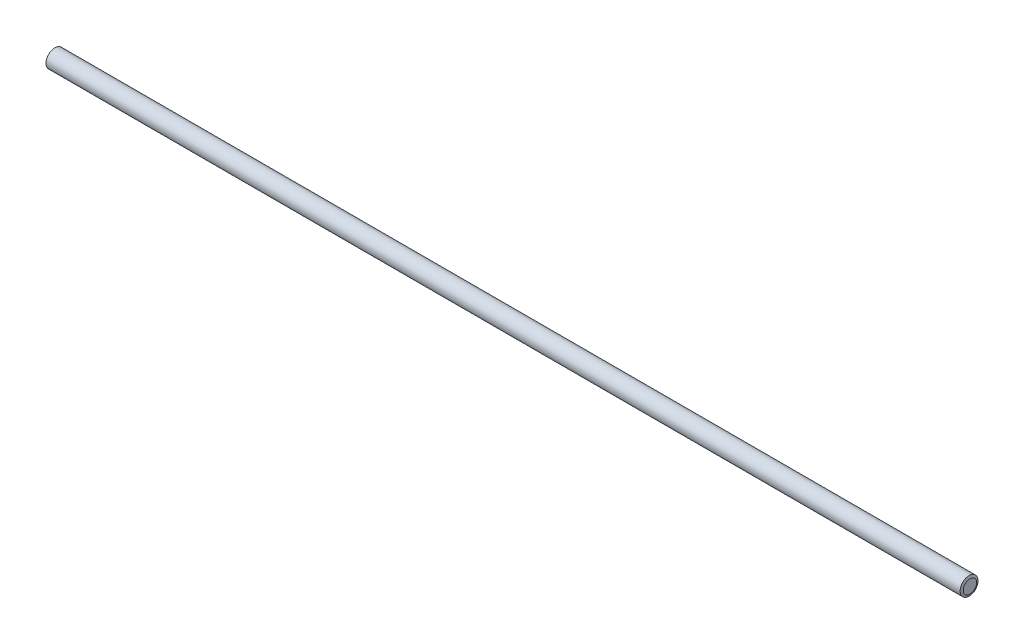
ISO-10303-21;
HEADER;
FILE_DESCRIPTION(('STEP AP214'),'2;1');
FILE_NAME('part.step','',(''),(''),'','','');
FILE_SCHEMA(('AUTOMOTIVE_DESIGN { 1 0 10303 214 1 1 1 1 }'));
ENDSEC;
DATA;
#1=APPLICATION_CONTEXT('core data for automotive mechanical design processes');
#2=APPLICATION_PROTOCOL_DEFINITION('international standard','automotive_design',2000,#1);
#3=PRODUCT_CONTEXT('',#1,'mechanical');
#4=PRODUCT('Part','Part','',(#3));
#5=PRODUCT_RELATED_PRODUCT_CATEGORY('part','',(#4));
#6=PRODUCT_DEFINITION_FORMATION('','',#4);
#7=PRODUCT_DEFINITION_CONTEXT('part definition',#1,'design');
#8=PRODUCT_DEFINITION('design','',#6,#7);
#9=PRODUCT_DEFINITION_SHAPE('','',#8);
#10=(LENGTH_UNIT() NAMED_UNIT(*) SI_UNIT(.MILLI.,.METRE.));
#11=(NAMED_UNIT(*) PLANE_ANGLE_UNIT() SI_UNIT($,.RADIAN.));
#12=(NAMED_UNIT(*) SI_UNIT($,.STERADIAN.) SOLID_ANGLE_UNIT());
#13=UNCERTAINTY_MEASURE_WITH_UNIT(LENGTH_MEASURE(1.E-05),#10,'distance_accuracy_value','');
#14=(GEOMETRIC_REPRESENTATION_CONTEXT(3) GLOBAL_UNCERTAINTY_ASSIGNED_CONTEXT((#13)) GLOBAL_UNIT_ASSIGNED_CONTEXT((#10,
#11,#12)) REPRESENTATION_CONTEXT('',''));
#15=CARTESIAN_POINT('',(0.,0.,0.));
#16=DIRECTION('',(0.,0.,1.));
#17=DIRECTION('',(1.,0.,0.));
#18=AXIS2_PLACEMENT_3D('',#15,#16,#17);
#19=CARTESIAN_POINT('',(0.,0.,0.));
#20=DIRECTION('',(1.,0.,0.));
#21=DIRECTION('',(0.,0.,-1.));
#22=AXIS2_PLACEMENT_3D('',#19,#20,#21);
#23=PLANE('',#22);
#24=CARTESIAN_POINT('',(0.,0.,0.));
#25=DIRECTION('',(-1.,0.,0.));
#26=DIRECTION('',(0.,0.,1.));
#27=AXIS2_PLACEMENT_3D('',#24,#25,#26);
#28=CIRCLE('',#27,3.73694599963691);
#29=CARTESIAN_POINT('',(0.,0.,3.73694599963691));
#30=VERTEX_POINT('',#29);
#31=EDGE_CURVE('E10',#30,#30,#28,.T.);
#32=ORIENTED_EDGE('',*,*,#31,.T.);
#33=EDGE_LOOP('',(#32));
#34=FACE_BOUND('',#33,.T.);
#35=ADVANCED_FACE('F30',(#34),#23,.F.);
#36=CARTESIAN_POINT('',(0.499999999999945,0.,0.));
#37=DIRECTION('',(1.,0.,0.));
#38=DIRECTION('',(0.,0.,-1.));
#39=AXIS2_PLACEMENT_3D('',#36,#37,#38);
#40=CONICAL_SURFACE('',#39,4.99999999999992,1.19385890747491);
#41=ORIENTED_EDGE('',*,*,#31,.F.);
#42=EDGE_LOOP('',(#41));
#43=FACE_BOUND('',#42,.T.);
#44=CARTESIAN_POINT('',(0.499999999999945,0.,0.));
#45=DIRECTION('',(-1.,0.,0.));
#46=DIRECTION('',(0.,0.,1.));
#47=AXIS2_PLACEMENT_3D('',#44,#45,#46);
#48=CIRCLE('',#47,4.99999999999992);
#49=CARTESIAN_POINT('',(0.499999999999945,0.,4.99999999999992));
#50=VERTEX_POINT('',#49);
#51=EDGE_CURVE('E36',#50,#50,#48,.T.);
#52=ORIENTED_EDGE('',*,*,#51,.T.);
#53=EDGE_LOOP('',(#52));
#54=FACE_BOUND('',#53,.T.);
#55=ADVANCED_FACE('F62',(#43,#54),#40,.T.);
#56=CARTESIAN_POINT('',(512.,0.,0.));
#57=DIRECTION('',(-1.,0.,0.));
#58=DIRECTION('',(0.,0.,1.));
#59=AXIS2_PLACEMENT_3D('',#56,#57,#58);
#60=CYLINDRICAL_SURFACE('',#59,4.99999999999993);
#61=ORIENTED_EDGE('',*,*,#51,.F.);
#62=EDGE_LOOP('',(#61));
#63=FACE_BOUND('',#62,.T.);
#64=CARTESIAN_POINT('',(511.5,0.,0.));
#65=DIRECTION('',(-1.,0.,0.));
#66=DIRECTION('',(0.,0.,1.));
#67=AXIS2_PLACEMENT_3D('',#64,#65,#66);
#68=CIRCLE('',#67,4.99999999999994);
#69=CARTESIAN_POINT('',(511.5,0.,4.99999999999994));
#70=VERTEX_POINT('',#69);
#71=EDGE_CURVE('E40',#70,#70,#68,.T.);
#72=ORIENTED_EDGE('',*,*,#71,.T.);
#73=EDGE_LOOP('',(#72));
#74=FACE_BOUND('',#73,.T.);
#75=ADVANCED_FACE('F58',(#63,#74),#60,.T.);
#76=CARTESIAN_POINT('',(512.,0.,0.));
#77=DIRECTION('',(-1.,0.,0.));
#78=DIRECTION('',(0.,0.,1.));
#79=AXIS2_PLACEMENT_3D('',#76,#77,#78);
#80=CONICAL_SURFACE('',#79,3.73694599963689,1.19385890747492);
#81=ORIENTED_EDGE('',*,*,#71,.F.);
#82=EDGE_LOOP('',(#81));
#83=FACE_BOUND('',#82,.T.);
#84=CARTESIAN_POINT('',(512.,0.,0.));
#85=DIRECTION('',(-1.,0.,0.));
#86=DIRECTION('',(0.,0.,1.));
#87=AXIS2_PLACEMENT_3D('',#84,#85,#86);
#88=CIRCLE('',#87,3.73694599963689);
#89=CARTESIAN_POINT('',(512.,0.,3.73694599963689));
#90=VERTEX_POINT('',#89);
#91=EDGE_CURVE('E44',#90,#90,#88,.T.);
#92=ORIENTED_EDGE('',*,*,#91,.T.);
#93=EDGE_LOOP('',(#92));
#94=FACE_BOUND('',#93,.T.);
#95=ADVANCED_FACE('F50',(#83,#94),#80,.T.);
#96=CARTESIAN_POINT('',(512.,3.73694599963689,0.));
#97=DIRECTION('',(-1.,0.,0.));
#98=DIRECTION('',(0.,0.,1.));
#99=AXIS2_PLACEMENT_3D('',#96,#97,#98);
#100=PLANE('',#99);
#101=ORIENTED_EDGE('',*,*,#91,.F.);
#102=EDGE_LOOP('',(#101));
#103=FACE_BOUND('',#102,.T.);
#104=ADVANCED_FACE('F52',(#103),#100,.F.);
#105=CLOSED_SHELL('',(#35,#55,#75,#95,#104));
#106=MANIFOLD_SOLID_BREP('B2',#105);
#107=ADVANCED_BREP_SHAPE_REPRESENTATION('',(#18,#106),#14);
#108=SHAPE_DEFINITION_REPRESENTATION(#9,#107);
ENDSEC;
END-ISO-10303-21;
